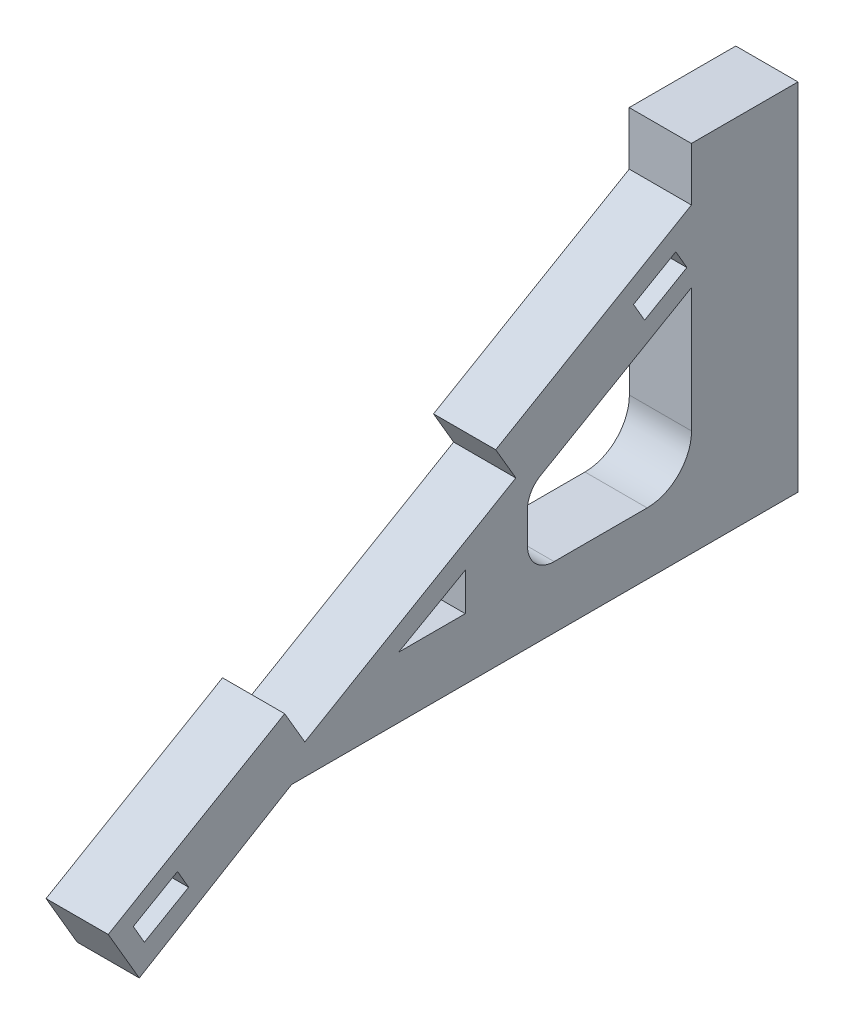
ISO-10303-21;
HEADER;
FILE_DESCRIPTION(('STEP AP214'),'2;1');
FILE_NAME('part.step','',(''),(''),'','','');
FILE_SCHEMA(('AUTOMOTIVE_DESIGN { 1 0 10303 214 1 1 1 1 }'));
ENDSEC;
DATA;
#1=APPLICATION_CONTEXT('core data for automotive mechanical design processes');
#2=APPLICATION_PROTOCOL_DEFINITION('international standard','automotive_design',2000,#1);
#3=PRODUCT_CONTEXT('',#1,'mechanical');
#4=PRODUCT('Part','Part','',(#3));
#5=PRODUCT_RELATED_PRODUCT_CATEGORY('part','',(#4));
#6=PRODUCT_DEFINITION_FORMATION('','',#4);
#7=PRODUCT_DEFINITION_CONTEXT('part definition',#1,'design');
#8=PRODUCT_DEFINITION('design','',#6,#7);
#9=PRODUCT_DEFINITION_SHAPE('','',#8);
#10=(LENGTH_UNIT() NAMED_UNIT(*) SI_UNIT(.MILLI.,.METRE.));
#11=(NAMED_UNIT(*) PLANE_ANGLE_UNIT() SI_UNIT($,.RADIAN.));
#12=(NAMED_UNIT(*) SI_UNIT($,.STERADIAN.) SOLID_ANGLE_UNIT());
#13=UNCERTAINTY_MEASURE_WITH_UNIT(LENGTH_MEASURE(1.E-05),#10,'distance_accuracy_value','');
#14=(GEOMETRIC_REPRESENTATION_CONTEXT(3) GLOBAL_UNCERTAINTY_ASSIGNED_CONTEXT((#13)) GLOBAL_UNIT_ASSIGNED_CONTEXT((#10,
#11,#12)) REPRESENTATION_CONTEXT('',''));
#15=CARTESIAN_POINT('',(0.,0.,0.));
#16=DIRECTION('',(0.,0.,1.));
#17=DIRECTION('',(1.,0.,0.));
#18=AXIS2_PLACEMENT_3D('',#15,#16,#17);
#19=CARTESIAN_POINT('',(-7.,-27.6650791483747,38.937098947957));
#20=DIRECTION('',(0.,-0.85757405597835,-0.514360514146296));
#21=DIRECTION('',(0.,0.514360514146296,-0.85757405597835));
#22=AXIS2_PLACEMENT_3D('',#19,#20,#21);
#23=PLANE('',#22);
#24=DIRECTION('',(0.,0.514360514146296,-0.85757405597835));
#25=VECTOR('',#24,1.);
#26=CARTESIAN_POINT('',(0.,-27.6650791483747,38.937098947957));
#27=LINE('',#26,#25);
#28=CARTESIAN_POINT('',(0.,-27.6650791483747,38.937098947957));
#29=VERTEX_POINT('',#28);
#30=CARTESIAN_POINT('',(0.,-17.3778688654487,21.78561782839));
#31=VERTEX_POINT('',#30);
#32=EDGE_CURVE('E345',#29,#31,#27,.T.);
#33=ORIENTED_EDGE('',*,*,#32,.F.);
#34=DIRECTION('',(1.,0.,0.));
#35=VECTOR('',#34,1.);
#36=CARTESIAN_POINT('',(-7.,-27.6650791483747,38.937098947957));
#37=LINE('',#36,#35);
#38=CARTESIAN_POINT('',(-7.,-27.6650791483747,38.937098947957));
#39=VERTEX_POINT('',#38);
#40=EDGE_CURVE('E416',#39,#29,#37,.T.);
#41=ORIENTED_EDGE('',*,*,#40,.F.);
#42=DIRECTION('',(0.,0.514360514146296,-0.85757405597835));
#43=VECTOR('',#42,1.);
#44=CARTESIAN_POINT('',(-7.,-27.6650791483747,38.937098947957));
#45=LINE('',#44,#43);
#46=CARTESIAN_POINT('',(-7.,-17.3778688654487,21.78561782839));
#47=VERTEX_POINT('',#46);
#48=EDGE_CURVE('E350',#39,#47,#45,.T.);
#49=ORIENTED_EDGE('',*,*,#48,.T.);
#50=DIRECTION('',(1.,0.,0.));
#51=VECTOR('',#50,1.);
#52=CARTESIAN_POINT('',(-7.,-17.3778688654487,21.78561782839));
#53=LINE('',#52,#51);
#54=EDGE_CURVE('E384',#47,#31,#53,.T.);
#55=ORIENTED_EDGE('',*,*,#54,.T.);
#56=EDGE_LOOP('',(#33,#41,#49,#55));
#57=FACE_BOUND('',#56,.T.);
#58=ADVANCED_FACE('F33',(#57),#23,.T.);
#59=CARTESIAN_POINT('',(-7.,-21.6703628112709,42.4338082635359));
#60=DIRECTION('',(0.,-0.503848604550291,0.863791979409814));
#61=DIRECTION('',(0.,-0.863791979409814,-0.503848604550291));
#62=AXIS2_PLACEMENT_3D('',#59,#60,#61);
#63=PLANE('',#62);
#64=DIRECTION('',(0.,-0.863791979409814,-0.503848604550291));
#65=VECTOR('',#64,1.);
#66=CARTESIAN_POINT('',(0.,-21.6703628112709,42.4338082635359));
#67=LINE('',#66,#65);
#68=CARTESIAN_POINT('',(0.,-21.6703628112709,42.4338082635359));
#69=VERTEX_POINT('',#68);
#70=EDGE_CURVE('E354',#69,#29,#67,.T.);
#71=ORIENTED_EDGE('',*,*,#70,.F.);
#72=DIRECTION('',(1.,0.,0.));
#73=VECTOR('',#72,1.);
#74=CARTESIAN_POINT('',(-7.,-21.6703628112709,42.4338082635359));
#75=LINE('',#74,#73);
#76=CARTESIAN_POINT('',(-7.,-21.6703628112709,42.4338082635359));
#77=VERTEX_POINT('',#76);
#78=EDGE_CURVE('E419',#77,#69,#75,.T.);
#79=ORIENTED_EDGE('',*,*,#78,.F.);
#80=DIRECTION('',(0.,-0.863791979409814,-0.503848604550291));
#81=VECTOR('',#80,1.);
#82=CARTESIAN_POINT('',(-7.,-21.6703628112709,42.4338082635359));
#83=LINE('',#82,#81);
#84=EDGE_CURVE('E381',#77,#39,#83,.T.);
#85=ORIENTED_EDGE('',*,*,#84,.T.);
#86=ORIENTED_EDGE('',*,*,#40,.T.);
#87=EDGE_LOOP('',(#71,#79,#85,#86));
#88=FACE_BOUND('',#87,.T.);
#89=ADVANCED_FACE('F476',(#88),#63,.T.);
#90=CARTESIAN_POINT('',(-7.,-10.0818449066142,22.5665927371102));
#91=DIRECTION('',(0.,0.863791979409814,0.503848604550291));
#92=DIRECTION('',(0.,-0.503848604550291,0.863791979409814));
#93=AXIS2_PLACEMENT_3D('',#90,#91,#92);
#94=PLANE('',#93);
#95=DIRECTION('',(0.,-0.503848604550291,0.863791979409814));
#96=VECTOR('',#95,1.);
#97=CARTESIAN_POINT('',(0.,-10.0818449066142,22.5665927371102));
#98=LINE('',#97,#96);
#99=CARTESIAN_POINT('',(0.,-10.0818449066142,22.5665927371102));
#100=VERTEX_POINT('',#99);
#101=EDGE_CURVE('E411',#100,#69,#98,.T.);
#102=ORIENTED_EDGE('',*,*,#101,.F.);
#103=DIRECTION('',(1.,0.,0.));
#104=VECTOR('',#103,1.);
#105=CARTESIAN_POINT('',(-7.,-10.0818449066142,22.5665927371102));
#106=LINE('',#105,#104);
#107=CARTESIAN_POINT('',(-7.,-10.0818449066142,22.5665927371102));
#108=VERTEX_POINT('',#107);
#109=EDGE_CURVE('E421',#108,#100,#106,.T.);
#110=ORIENTED_EDGE('',*,*,#109,.F.);
#111=DIRECTION('',(0.,-0.503848604550291,0.863791979409814));
#112=VECTOR('',#111,1.);
#113=CARTESIAN_POINT('',(-7.,-10.0818449066142,22.5665927371102));
#114=LINE('',#113,#112);
#115=EDGE_CURVE('E378',#108,#77,#114,.T.);
#116=ORIENTED_EDGE('',*,*,#115,.T.);
#117=ORIENTED_EDGE('',*,*,#78,.T.);
#118=EDGE_LOOP('',(#102,#110,#116,#117));
#119=FACE_BOUND('',#118,.T.);
#120=ADVANCED_FACE('F482',(#119),#94,.T.);
#121=CARTESIAN_POINT('',(-7.,-13.9689088139583,20.2992740166338));
#122=DIRECTION('',(0.,0.503848604550291,-0.863791979409814));
#123=DIRECTION('',(0.,0.863791979409814,0.503848604550291));
#124=AXIS2_PLACEMENT_3D('',#121,#122,#123);
#125=PLANE('',#124);
#126=DIRECTION('',(0.,0.863791979409814,0.503848604550291));
#127=VECTOR('',#126,1.);
#128=CARTESIAN_POINT('',(0.,-13.9689088139583,20.2992740166338));
#129=LINE('',#128,#127);
#130=CARTESIAN_POINT('',(0.,-13.9689088139583,20.2992740166338));
#131=VERTEX_POINT('',#130);
#132=EDGE_CURVE('E408',#131,#100,#129,.T.);
#133=ORIENTED_EDGE('',*,*,#132,.F.);
#134=DIRECTION('',(1.,0.,0.));
#135=VECTOR('',#134,1.);
#136=CARTESIAN_POINT('',(-7.,-13.9689088139583,20.2992740166338));
#137=LINE('',#136,#135);
#138=CARTESIAN_POINT('',(-7.,-13.9689088139583,20.2992740166338));
#139=VERTEX_POINT('',#138);
#140=EDGE_CURVE('E423',#139,#131,#137,.T.);
#141=ORIENTED_EDGE('',*,*,#140,.F.);
#142=DIRECTION('',(0.,0.863791979409814,0.503848604550291));
#143=VECTOR('',#142,1.);
#144=CARTESIAN_POINT('',(-7.,-13.9689088139583,20.2992740166338));
#145=LINE('',#144,#143);
#146=EDGE_CURVE('E375',#139,#108,#145,.T.);
#147=ORIENTED_EDGE('',*,*,#146,.T.);
#148=ORIENTED_EDGE('',*,*,#109,.T.);
#149=EDGE_LOOP('',(#133,#141,#147,#148));
#150=FACE_BOUND('',#149,.T.);
#151=ADVANCED_FACE('F555',(#150),#125,.T.);
#152=CARTESIAN_POINT('',(-7.,-0.113072188825318,-3.45500541713603));
#153=DIRECTION('',(0.,0.863791979409814,0.503848604550291));
#154=DIRECTION('',(0.,-0.503848604550291,0.863791979409814));
#155=AXIS2_PLACEMENT_3D('',#152,#153,#154);
#156=PLANE('',#155);
#157=DIRECTION('',(0.,-0.503848604550291,0.863791979409814));
#158=VECTOR('',#157,1.);
#159=CARTESIAN_POINT('',(0.,-0.113072188825318,-3.45500541713603));
#160=LINE('',#159,#158);
#161=CARTESIAN_POINT('',(0.,-0.113072188825318,-3.45500541713603));
#162=VERTEX_POINT('',#161);
#163=EDGE_CURVE('E405',#162,#131,#160,.T.);
#164=ORIENTED_EDGE('',*,*,#163,.F.);
#165=DIRECTION('',(1.,0.,0.));
#166=VECTOR('',#165,1.);
#167=CARTESIAN_POINT('',(-7.,-0.113072188825318,-3.45500541713603));
#168=LINE('',#167,#166);
#169=CARTESIAN_POINT('',(-7.,-0.113072188825318,-3.45500541713603));
#170=VERTEX_POINT('',#169);
#171=EDGE_CURVE('E425',#170,#162,#168,.T.);
#172=ORIENTED_EDGE('',*,*,#171,.F.);
#173=DIRECTION('',(0.,-0.503848604550291,0.863791979409814));
#174=VECTOR('',#173,1.);
#175=CARTESIAN_POINT('',(-7.,-0.113072188825318,-3.45500541713603));
#176=LINE('',#175,#174);
#177=EDGE_CURVE('E372',#170,#139,#176,.T.);
#178=ORIENTED_EDGE('',*,*,#177,.T.);
#179=ORIENTED_EDGE('',*,*,#140,.T.);
#180=EDGE_LOOP('',(#164,#172,#178,#179));
#181=FACE_BOUND('',#180,.T.);
#182=ADVANCED_FACE('F559',(#181),#156,.T.);
#183=CARTESIAN_POINT('',(-7.,3.77399171851884,-1.18768669665972));
#184=DIRECTION('',(0.,-0.503848604550291,0.863791979409814));
#185=DIRECTION('',(0.,-0.863791979409814,-0.503848604550291));
#186=AXIS2_PLACEMENT_3D('',#183,#184,#185);
#187=PLANE('',#186);
#188=DIRECTION('',(0.,-0.863791979409814,-0.503848604550291));
#189=VECTOR('',#188,1.);
#190=CARTESIAN_POINT('',(0.,3.77399171851884,-1.18768669665972));
#191=LINE('',#190,#189);
#192=CARTESIAN_POINT('',(0.,3.77399171851884,-1.18768669665972));
#193=VERTEX_POINT('',#192);
#194=EDGE_CURVE('E402',#193,#162,#191,.T.);
#195=ORIENTED_EDGE('',*,*,#194,.F.);
#196=DIRECTION('',(1.,0.,0.));
#197=VECTOR('',#196,1.);
#198=CARTESIAN_POINT('',(-7.,3.77399171851884,-1.18768669665972));
#199=LINE('',#198,#197);
#200=CARTESIAN_POINT('',(-7.,3.77399171851884,-1.18768669665972));
#201=VERTEX_POINT('',#200);
#202=EDGE_CURVE('E427',#201,#193,#199,.T.);
#203=ORIENTED_EDGE('',*,*,#202,.F.);
#204=DIRECTION('',(0.,-0.863791979409814,-0.503848604550291));
#205=VECTOR('',#204,1.);
#206=CARTESIAN_POINT('',(-7.,3.77399171851884,-1.18768669665972));
#207=LINE('',#206,#205);
#208=EDGE_CURVE('E369',#201,#170,#207,.T.);
#209=ORIENTED_EDGE('',*,*,#208,.T.);
#210=ORIENTED_EDGE('',*,*,#171,.T.);
#211=EDGE_LOOP('',(#195,#203,#209,#210));
#212=FACE_BOUND('',#211,.T.);
#213=ADVANCED_FACE('F563',(#212),#187,.T.);
#214=CARTESIAN_POINT('',(-7.,3.77399171851884,-1.18768669665972));
#215=DIRECTION('',(0.,0.863791979409813,0.503848604550292));
#216=DIRECTION('',(0.,-0.503848604550292,0.863791979409814));
#217=AXIS2_PLACEMENT_3D('',#214,#215,#216);
#218=PLANE('',#217);
#219=DIRECTION('',(0.,-0.503848604550292,0.863791979409813));
#220=VECTOR('',#219,1.);
#221=CARTESIAN_POINT('',(0.,3.77399171851884,-1.18768669665972));
#222=LINE('',#221,#220);
#223=CARTESIAN_POINT('',(0.,16.6221311345513,-23.21438217161));
#224=VERTEX_POINT('',#223);
#225=EDGE_CURVE('E399',#224,#193,#222,.T.);
#226=ORIENTED_EDGE('',*,*,#225,.F.);
#227=DIRECTION('',(1.,0.,0.));
#228=VECTOR('',#227,1.);
#229=CARTESIAN_POINT('',(-7.,16.6221311345513,-23.21438217161));
#230=LINE('',#229,#228);
#231=CARTESIAN_POINT('',(-7.,16.6221311345513,-23.21438217161));
#232=VERTEX_POINT('',#231);
#233=EDGE_CURVE('E429',#232,#224,#230,.T.);
#234=ORIENTED_EDGE('',*,*,#233,.F.);
#235=DIRECTION('',(0.,-0.503848604550292,0.863791979409813));
#236=VECTOR('',#235,1.);
#237=CARTESIAN_POINT('',(-7.,3.77399171851884,-1.18768669665972));
#238=LINE('',#237,#236);
#239=EDGE_CURVE('E366',#232,#201,#238,.T.);
#240=ORIENTED_EDGE('',*,*,#239,.T.);
#241=ORIENTED_EDGE('',*,*,#202,.T.);
#242=EDGE_LOOP('',(#226,#234,#240,#241));
#243=FACE_BOUND('',#242,.T.);
#244=ADVANCED_FACE('F567',(#243),#218,.T.);
#245=CARTESIAN_POINT('',(-7.,22.6221311345513,-23.21438217161));
#246=DIRECTION('',(0.,0.,1.));
#247=DIRECTION('',(1.,0.,0.));
#248=AXIS2_PLACEMENT_3D('',#245,#246,#247);
#249=PLANE('',#248);
#250=DIRECTION('',(0.,-1.,0.));
#251=VECTOR('',#250,1.);
#252=CARTESIAN_POINT('',(0.,22.6221311345513,-23.21438217161));
#253=LINE('',#252,#251);
#254=CARTESIAN_POINT('',(0.,22.6221311345513,-23.21438217161));
#255=VERTEX_POINT('',#254);
#256=EDGE_CURVE('E396',#255,#224,#253,.T.);
#257=ORIENTED_EDGE('',*,*,#256,.F.);
#258=DIRECTION('',(1.,0.,0.));
#259=VECTOR('',#258,1.);
#260=CARTESIAN_POINT('',(-7.,22.6221311345513,-23.21438217161));
#261=LINE('',#260,#259);
#262=CARTESIAN_POINT('',(-7.,22.6221311345513,-23.21438217161));
#263=VERTEX_POINT('',#262);
#264=EDGE_CURVE('E431',#263,#255,#261,.T.);
#265=ORIENTED_EDGE('',*,*,#264,.F.);
#266=DIRECTION('',(0.,-1.,0.));
#267=VECTOR('',#266,1.);
#268=CARTESIAN_POINT('',(-7.,22.6221311345513,-23.21438217161));
#269=LINE('',#268,#267);
#270=EDGE_CURVE('E363',#263,#232,#269,.T.);
#271=ORIENTED_EDGE('',*,*,#270,.T.);
#272=ORIENTED_EDGE('',*,*,#233,.T.);
#273=EDGE_LOOP('',(#257,#265,#271,#272));
#274=FACE_BOUND('',#273,.T.);
#275=ADVANCED_FACE('F571',(#274),#249,.T.);
#276=CARTESIAN_POINT('',(-7.,22.6221311345513,-35.21438217161));
#277=DIRECTION('',(0.,1.,0.));
#278=DIRECTION('',(0.,0.,1.));
#279=AXIS2_PLACEMENT_3D('',#276,#277,#278);
#280=PLANE('',#279);
#281=DIRECTION('',(0.,0.,1.));
#282=VECTOR('',#281,1.);
#283=CARTESIAN_POINT('',(0.,22.6221311345513,-35.21438217161));
#284=LINE('',#283,#282);
#285=CARTESIAN_POINT('',(0.,22.6221311345513,-35.21438217161));
#286=VERTEX_POINT('',#285);
#287=EDGE_CURVE('E393',#286,#255,#284,.T.);
#288=ORIENTED_EDGE('',*,*,#287,.F.);
#289=DIRECTION('',(1.,0.,0.));
#290=VECTOR('',#289,1.);
#291=CARTESIAN_POINT('',(-7.,22.6221311345513,-35.21438217161));
#292=LINE('',#291,#290);
#293=CARTESIAN_POINT('',(-7.,22.6221311345513,-35.21438217161));
#294=VERTEX_POINT('',#293);
#295=EDGE_CURVE('E433',#294,#286,#292,.T.);
#296=ORIENTED_EDGE('',*,*,#295,.F.);
#297=DIRECTION('',(0.,0.,1.));
#298=VECTOR('',#297,1.);
#299=CARTESIAN_POINT('',(-7.,22.6221311345513,-35.21438217161));
#300=LINE('',#299,#298);
#301=EDGE_CURVE('E360',#294,#263,#300,.T.);
#302=ORIENTED_EDGE('',*,*,#301,.T.);
#303=ORIENTED_EDGE('',*,*,#264,.T.);
#304=EDGE_LOOP('',(#288,#296,#302,#303));
#305=FACE_BOUND('',#304,.T.);
#306=ADVANCED_FACE('F575',(#305),#280,.T.);
#307=CARTESIAN_POINT('',(-7.,-17.3778688654487,-35.21438217161));
#308=DIRECTION('',(0.,0.,-1.));
#309=DIRECTION('',(0.,1.,0.));
#310=AXIS2_PLACEMENT_3D('',#307,#308,#309);
#311=PLANE('',#310);
#312=DIRECTION('',(0.,1.,0.));
#313=VECTOR('',#312,1.);
#314=CARTESIAN_POINT('',(0.,-17.3778688654487,-35.21438217161));
#315=LINE('',#314,#313);
#316=CARTESIAN_POINT('',(0.,-17.3778688654487,-35.21438217161));
#317=VERTEX_POINT('',#316);
#318=EDGE_CURVE('E390',#317,#286,#315,.T.);
#319=ORIENTED_EDGE('',*,*,#318,.F.);
#320=DIRECTION('',(1.,0.,0.));
#321=VECTOR('',#320,1.);
#322=CARTESIAN_POINT('',(-7.,-17.3778688654487,-35.21438217161));
#323=LINE('',#322,#321);
#324=CARTESIAN_POINT('',(-7.,-17.3778688654487,-35.21438217161));
#325=VERTEX_POINT('',#324);
#326=EDGE_CURVE('E435',#325,#317,#323,.T.);
#327=ORIENTED_EDGE('',*,*,#326,.F.);
#328=DIRECTION('',(0.,1.,0.));
#329=VECTOR('',#328,1.);
#330=CARTESIAN_POINT('',(-7.,-17.3778688654487,-35.21438217161));
#331=LINE('',#330,#329);
#332=EDGE_CURVE('E357',#325,#294,#331,.T.);
#333=ORIENTED_EDGE('',*,*,#332,.T.);
#334=ORIENTED_EDGE('',*,*,#295,.T.);
#335=EDGE_LOOP('',(#319,#327,#333,#334));
#336=FACE_BOUND('',#335,.T.);
#337=ADVANCED_FACE('F578',(#336),#311,.T.);
#338=CARTESIAN_POINT('',(-7.,-17.3778688654487,21.78561782839));
#339=DIRECTION('',(0.,-1.,0.));
#340=DIRECTION('',(0.,0.,-1.));
#341=AXIS2_PLACEMENT_3D('',#338,#339,#340);
#342=PLANE('',#341);
#343=DIRECTION('',(0.,0.,-1.));
#344=VECTOR('',#343,1.);
#345=CARTESIAN_POINT('',(0.,-17.3778688654487,21.78561782839));
#346=LINE('',#345,#344);
#347=EDGE_CURVE('E387',#31,#317,#346,.T.);
#348=ORIENTED_EDGE('',*,*,#347,.F.);
#349=ORIENTED_EDGE('',*,*,#54,.F.);
#350=DIRECTION('',(0.,0.,-1.));
#351=VECTOR('',#350,1.);
#352=CARTESIAN_POINT('',(-7.,-17.3778688654487,21.78561782839));
#353=LINE('',#352,#351);
#354=EDGE_CURVE('E353',#47,#325,#353,.T.);
#355=ORIENTED_EDGE('',*,*,#354,.T.);
#356=ORIENTED_EDGE('',*,*,#326,.T.);
#357=EDGE_LOOP('',(#348,#349,#355,#356));
#358=FACE_BOUND('',#357,.T.);
#359=ADVANCED_FACE('F488',(#358),#342,.T.);
#360=CARTESIAN_POINT('',(-7.,0.,0.));
#361=DIRECTION('',(-1.,0.,0.));
#362=DIRECTION('',(0.,0.,1.));
#363=AXIS2_PLACEMENT_3D('',#360,#361,#362);
#364=PLANE('',#363);
#365=DIRECTION('',(0.,-0.500981396791888,0.865458052171478));
#366=VECTOR('',#365,1.);
#367=CARTESIAN_POINT('',(-7.,-1.3998859868204,-6.01160039361903));
#368=LINE('',#367,#366);
#369=CARTESIAN_POINT('',(-7.,8.5695865463671,-23.2341167085985));
#370=VERTEX_POINT('',#369);
#371=CARTESIAN_POINT('',(-7.,-1.3998859868204,-6.01160039361903));
#372=VERTEX_POINT('',#371);
#373=EDGE_CURVE('E229',#370,#372,#368,.T.);
#374=ORIENTED_EDGE('',*,*,#373,.T.);
#375=CARTESIAN_POINT('',(-7.,-3.8343262822422,-7.7647405614398));
#376=DIRECTION('',(-1.,0.,0.));
#377=DIRECTION('',(0.,0.,1.));
#378=AXIS2_PLACEMENT_3D('',#375,#376,#377);
#379=CIRCLE('',#378,3.);
#380=CARTESIAN_POINT('',(-7.,-3.8343262822422,-4.7647405614398));
#381=VERTEX_POINT('',#380);
#382=EDGE_CURVE('E451',#372,#381,#379,.F.);
#383=ORIENTED_EDGE('',*,*,#382,.T.);
#384=DIRECTION('',(0.,-1.,0.));
#385=VECTOR('',#384,1.);
#386=CARTESIAN_POINT('',(-7.,-1.3998859868204,-4.7647405614398));
#387=LINE('',#386,#385);
#388=CARTESIAN_POINT('',(-7.,-7.41786886544872,-4.7647405614398));
#389=VERTEX_POINT('',#388);
#390=EDGE_CURVE('E259',#381,#389,#387,.T.);
#391=ORIENTED_EDGE('',*,*,#390,.T.);
#392=CARTESIAN_POINT('',(-7.,-7.41786886544872,-7.7647405614398));
#393=DIRECTION('',(-1.,0.,0.));
#394=DIRECTION('',(0.,0.,1.));
#395=AXIS2_PLACEMENT_3D('',#392,#393,#394);
#396=CIRCLE('',#395,3.);
#397=CARTESIAN_POINT('',(-7.,-10.4178688654487,-7.7647405614398));
#398=VERTEX_POINT('',#397);
#399=EDGE_CURVE('E447',#389,#398,#396,.F.);
#400=ORIENTED_EDGE('',*,*,#399,.T.);
#401=DIRECTION('',(0.,0.,-1.));
#402=VECTOR('',#401,1.);
#403=CARTESIAN_POINT('',(-7.,-10.4178688654487,-4.7647405614398));
#404=LINE('',#403,#402);
#405=CARTESIAN_POINT('',(-7.,-10.4178688654487,-18.2341167085985));
#406=VERTEX_POINT('',#405);
#407=EDGE_CURVE('E235',#398,#406,#404,.T.);
#408=ORIENTED_EDGE('',*,*,#407,.T.);
#409=CARTESIAN_POINT('',(-7.,-5.41786886544872,-18.2341167085985));
#410=DIRECTION('',(-1.,0.,0.));
#411=DIRECTION('',(0.,0.,1.));
#412=AXIS2_PLACEMENT_3D('',#409,#410,#411);
#413=CIRCLE('',#412,5.);
#414=CARTESIAN_POINT('',(-7.,-5.41786886544873,-23.2341167085985));
#415=VERTEX_POINT('',#414);
#416=EDGE_CURVE('E11',#406,#415,#413,.F.);
#417=ORIENTED_EDGE('',*,*,#416,.T.);
#418=DIRECTION('',(0.,1.,0.));
#419=VECTOR('',#418,1.);
#420=CARTESIAN_POINT('',(-7.,8.5695865463671,-23.2341167085985));
#421=LINE('',#420,#419);
#422=EDGE_CURVE('E224',#415,#370,#421,.T.);
#423=ORIENTED_EDGE('',*,*,#422,.T.);
#424=EDGE_LOOP('',(#374,#383,#391,#400,#408,#417,#423));
#425=FACE_BOUND('',#424,.T.);
#426=DIRECTION('',(0.,-0.500981396791888,0.865458052171478));
#427=VECTOR('',#426,1.);
#428=CARTESIAN_POINT('',(-7.,12.9382598453727,-21.4594061879204));
#429=LINE('',#428,#427);
#430=CARTESIAN_POINT('',(-7.,12.9382598453727,-21.4594061879204));
#431=VERTEX_POINT('',#430);
#432=CARTESIAN_POINT('',(-7.,10.1828615425791,-16.6993858291544));
#433=VERTEX_POINT('',#432);
#434=EDGE_CURVE('E262',#431,#433,#429,.T.);
#435=ORIENTED_EDGE('',*,*,#434,.T.);
#436=DIRECTION('',(0.,-0.865458052171479,-0.500981396791887));
#437=VECTOR('',#436,1.);
#438=CARTESIAN_POINT('',(-7.,10.1828615425791,-16.6993858291544));
#439=LINE('',#438,#437);
#440=CARTESIAN_POINT('',(-7.,8.01921603179754,-17.9518395413062));
#441=VERTEX_POINT('',#440);
#442=EDGE_CURVE('E265',#433,#441,#439,.T.);
#443=ORIENTED_EDGE('',*,*,#442,.T.);
#444=DIRECTION('',(0.,0.500981396791888,-0.865458052171478));
#445=VECTOR('',#444,1.);
#446=CARTESIAN_POINT('',(-7.,8.01921603179754,-17.9518395413062));
#447=LINE('',#446,#445);
#448=CARTESIAN_POINT('',(-7.,10.7746143345912,-22.7118599000722));
#449=VERTEX_POINT('',#448);
#450=EDGE_CURVE('E269',#441,#449,#447,.T.);
#451=ORIENTED_EDGE('',*,*,#450,.T.);
#452=DIRECTION('',(0.,0.865458052171478,0.500981396791889));
#453=VECTOR('',#452,1.);
#454=CARTESIAN_POINT('',(-7.,10.7746143345912,-22.7118599000722));
#455=LINE('',#454,#453);
#456=EDGE_CURVE('E272',#449,#431,#455,.T.);
#457=ORIENTED_EDGE('',*,*,#456,.T.);
#458=EDGE_LOOP('',(#435,#443,#451,#457));
#459=FACE_BOUND('',#458,.T.);
#460=DIRECTION('',(0.,0.500074816710874,-0.865982204027072));
#461=VECTOR('',#460,1.);
#462=CARTESIAN_POINT('',(-7.,-21.5940753603504,33.3843022393859));
#463=LINE('',#462,#461);
#464=CARTESIAN_POINT('',(-7.,-24.4695055564379,38.3636999125415));
#465=VERTEX_POINT('',#464);
#466=CARTESIAN_POINT('',(-7.,-21.5940753603504,33.3843022393859));
#467=VERTEX_POINT('',#466);
#468=EDGE_CURVE('E294',#465,#467,#463,.T.);
#469=ORIENTED_EDGE('',*,*,#468,.T.);
#470=DIRECTION('',(0.,0.865982204027073,0.500074816710872));
#471=VECTOR('',#470,1.);
#472=CARTESIAN_POINT('',(-7.,-19.4291198502827,34.6344892811631));
#473=LINE('',#472,#471);
#474=CARTESIAN_POINT('',(-7.,-19.4291198502827,34.6344892811631));
#475=VERTEX_POINT('',#474);
#476=EDGE_CURVE('E297',#467,#475,#473,.T.);
#477=ORIENTED_EDGE('',*,*,#476,.T.);
#478=DIRECTION('',(0.,-0.500074816710877,0.865982204027071));
#479=VECTOR('',#478,1.);
#480=CARTESIAN_POINT('',(-7.,-22.3045500463703,39.6138869543187));
#481=LINE('',#480,#479);
#482=CARTESIAN_POINT('',(-7.,-22.3045500463703,39.6138869543187));
#483=VERTEX_POINT('',#482);
#484=EDGE_CURVE('E301',#475,#483,#481,.T.);
#485=ORIENTED_EDGE('',*,*,#484,.T.);
#486=DIRECTION('',(0.,-0.865982204027069,-0.500074816710879));
#487=VECTOR('',#486,1.);
#488=CARTESIAN_POINT('',(-7.,-24.4695055564379,38.3636999125415));
#489=LINE('',#488,#487);
#490=EDGE_CURVE('E304',#483,#465,#489,.T.);
#491=ORIENTED_EDGE('',*,*,#490,.T.);
#492=EDGE_LOOP('',(#469,#477,#485,#491));
#493=FACE_BOUND('',#492,.T.);
#494=DIRECTION('',(0.,-0.492954378318377,0.870055159686294));
#495=VECTOR('',#494,1.);
#496=CARTESIAN_POINT('',(-7.,-6.24837216225993,2.23525943856018));
#497=LINE('',#496,#495);
#498=CARTESIAN_POINT('',(-7.,-6.24837216225993,2.23525943856018));
#499=VERTEX_POINT('',#498);
#500=CARTESIAN_POINT('',(-7.,-10.4978688654487,9.73554079378812));
#501=VERTEX_POINT('',#500);
#502=EDGE_CURVE('E326',#499,#501,#497,.T.);
#503=ORIENTED_EDGE('',*,*,#502,.T.);
#504=DIRECTION('',(0.,0.,-1.));
#505=VECTOR('',#504,1.);
#506=CARTESIAN_POINT('',(-7.,-10.4978688654487,9.73554079378812));
#507=LINE('',#506,#505);
#508=CARTESIAN_POINT('',(-7.,-10.4978688654487,2.2352594385602));
#509=VERTEX_POINT('',#508);
#510=EDGE_CURVE('E329',#501,#509,#507,.T.);
#511=ORIENTED_EDGE('',*,*,#510,.T.);
#512=DIRECTION('',(0.,1.,0.));
#513=VECTOR('',#512,1.);
#514=CARTESIAN_POINT('',(-7.,-10.4978688654487,2.2352594385602));
#515=LINE('',#514,#513);
#516=EDGE_CURVE('E333',#509,#499,#515,.T.);
#517=ORIENTED_EDGE('',*,*,#516,.T.);
#518=EDGE_LOOP('',(#503,#511,#517));
#519=FACE_BOUND('',#518,.T.);
#520=ORIENTED_EDGE('',*,*,#48,.F.);
#521=ORIENTED_EDGE('',*,*,#84,.F.);
#522=ORIENTED_EDGE('',*,*,#115,.F.);
#523=ORIENTED_EDGE('',*,*,#146,.F.);
#524=ORIENTED_EDGE('',*,*,#177,.F.);
#525=ORIENTED_EDGE('',*,*,#208,.F.);
#526=ORIENTED_EDGE('',*,*,#239,.F.);
#527=ORIENTED_EDGE('',*,*,#270,.F.);
#528=ORIENTED_EDGE('',*,*,#301,.F.);
#529=ORIENTED_EDGE('',*,*,#332,.F.);
#530=ORIENTED_EDGE('',*,*,#354,.F.);
#531=EDGE_LOOP('',(#520,#521,#522,#523,#524,#525,#526,#527,#528,#529,#530));
#532=FACE_BOUND('',#531,.T.);
#533=ADVANCED_FACE('F226',(#425,#459,#493,#519,#532),#364,.T.);
#534=CARTESIAN_POINT('',(0.,0.,0.));
#535=DIRECTION('',(-1.,0.,0.));
#536=DIRECTION('',(0.,0.,1.));
#537=AXIS2_PLACEMENT_3D('',#534,#535,#536);
#538=PLANE('',#537);
#539=DIRECTION('',(0.,0.,-1.));
#540=VECTOR('',#539,1.);
#541=CARTESIAN_POINT('',(0.,-10.4178688654487,-4.7647405614398));
#542=LINE('',#541,#540);
#543=CARTESIAN_POINT('',(0.,-10.4178688654487,-7.7647405614398));
#544=VERTEX_POINT('',#543);
#545=CARTESIAN_POINT('',(0.,-10.4178688654487,-18.2341167085985));
#546=VERTEX_POINT('',#545);
#547=EDGE_CURVE('E254',#544,#546,#542,.T.);
#548=ORIENTED_EDGE('',*,*,#547,.F.);
#549=CARTESIAN_POINT('',(0.,-7.41786886544872,-7.7647405614398));
#550=DIRECTION('',(-1.,0.,0.));
#551=DIRECTION('',(0.,0.,1.));
#552=AXIS2_PLACEMENT_3D('',#549,#550,#551);
#553=CIRCLE('',#552,3.);
#554=CARTESIAN_POINT('',(0.,-7.41786886544872,-4.7647405614398));
#555=VERTEX_POINT('',#554);
#556=EDGE_CURVE('E445',#544,#555,#553,.T.);
#557=ORIENTED_EDGE('',*,*,#556,.T.);
#558=DIRECTION('',(0.,-1.,0.));
#559=VECTOR('',#558,1.);
#560=CARTESIAN_POINT('',(0.,-1.3998859868204,-4.7647405614398));
#561=LINE('',#560,#559);
#562=CARTESIAN_POINT('',(0.,-3.8343262822422,-4.7647405614398));
#563=VERTEX_POINT('',#562);
#564=EDGE_CURVE('E251',#563,#555,#561,.T.);
#565=ORIENTED_EDGE('',*,*,#564,.F.);
#566=CARTESIAN_POINT('',(0.,-3.8343262822422,-7.7647405614398));
#567=DIRECTION('',(-1.,0.,0.));
#568=DIRECTION('',(0.,0.,1.));
#569=AXIS2_PLACEMENT_3D('',#566,#567,#568);
#570=CIRCLE('',#569,3.);
#571=CARTESIAN_POINT('',(0.,-1.3998859868204,-6.01160039361903));
#572=VERTEX_POINT('',#571);
#573=EDGE_CURVE('E449',#563,#572,#570,.T.);
#574=ORIENTED_EDGE('',*,*,#573,.T.);
#575=DIRECTION('',(0.,-0.500981396791888,0.865458052171478));
#576=VECTOR('',#575,1.);
#577=CARTESIAN_POINT('',(0.,-1.3998859868204,-6.01160039361903));
#578=LINE('',#577,#576);
#579=CARTESIAN_POINT('',(0.,8.5695865463671,-23.2341167085985));
#580=VERTEX_POINT('',#579);
#581=EDGE_CURVE('E257',#580,#572,#578,.T.);
#582=ORIENTED_EDGE('',*,*,#581,.F.);
#583=DIRECTION('',(0.,1.,0.));
#584=VECTOR('',#583,1.);
#585=CARTESIAN_POINT('',(0.,8.5695865463671,-23.2341167085985));
#586=LINE('',#585,#584);
#587=CARTESIAN_POINT('',(0.,-5.41786886544873,-23.2341167085985));
#588=VERTEX_POINT('',#587);
#589=EDGE_CURVE('E240',#588,#580,#586,.T.);
#590=ORIENTED_EDGE('',*,*,#589,.F.);
#591=CARTESIAN_POINT('',(0.,-5.41786886544872,-18.2341167085985));
#592=DIRECTION('',(-1.,0.,0.));
#593=DIRECTION('',(0.,0.,1.));
#594=AXIS2_PLACEMENT_3D('',#591,#592,#593);
#595=CIRCLE('',#594,5.);
#596=EDGE_CURVE('E41',#588,#546,#595,.T.);
#597=ORIENTED_EDGE('',*,*,#596,.T.);
#598=EDGE_LOOP('',(#548,#557,#565,#574,#582,#590,#597));
#599=FACE_BOUND('',#598,.T.);
#600=DIRECTION('',(0.,-0.865458052171479,-0.500981396791887));
#601=VECTOR('',#600,1.);
#602=CARTESIAN_POINT('',(0.,10.1828615425791,-16.6993858291544));
#603=LINE('',#602,#601);
#604=CARTESIAN_POINT('',(0.,10.1828615425791,-16.6993858291544));
#605=VERTEX_POINT('',#604);
#606=CARTESIAN_POINT('',(0.,8.01921603179754,-17.9518395413062));
#607=VERTEX_POINT('',#606);
#608=EDGE_CURVE('E277',#605,#607,#603,.T.);
#609=ORIENTED_EDGE('',*,*,#608,.F.);
#610=DIRECTION('',(0.,-0.500981396791888,0.865458052171478));
#611=VECTOR('',#610,1.);
#612=CARTESIAN_POINT('',(0.,12.9382598453727,-21.4594061879204));
#613=LINE('',#612,#611);
#614=CARTESIAN_POINT('',(0.,12.9382598453727,-21.4594061879204));
#615=VERTEX_POINT('',#614);
#616=EDGE_CURVE('E260',#615,#605,#613,.T.);
#617=ORIENTED_EDGE('',*,*,#616,.F.);
#618=DIRECTION('',(0.,0.865458052171478,0.500981396791889));
#619=VECTOR('',#618,1.);
#620=CARTESIAN_POINT('',(0.,10.7746143345912,-22.7118599000722));
#621=LINE('',#620,#619);
#622=CARTESIAN_POINT('',(0.,10.7746143345912,-22.7118599000722));
#623=VERTEX_POINT('',#622);
#624=EDGE_CURVE('E266',#623,#615,#621,.T.);
#625=ORIENTED_EDGE('',*,*,#624,.F.);
#626=DIRECTION('',(0.,0.500981396791888,-0.865458052171478));
#627=VECTOR('',#626,1.);
#628=CARTESIAN_POINT('',(0.,8.01921603179754,-17.9518395413062));
#629=LINE('',#628,#627);
#630=EDGE_CURVE('E280',#607,#623,#629,.T.);
#631=ORIENTED_EDGE('',*,*,#630,.F.);
#632=EDGE_LOOP('',(#609,#617,#625,#631));
#633=FACE_BOUND('',#632,.T.);
#634=DIRECTION('',(0.,0.865982204027073,0.500074816710872));
#635=VECTOR('',#634,1.);
#636=CARTESIAN_POINT('',(0.,-19.4291198502827,34.6344892811631));
#637=LINE('',#636,#635);
#638=CARTESIAN_POINT('',(0.,-21.5940753603504,33.3843022393859));
#639=VERTEX_POINT('',#638);
#640=CARTESIAN_POINT('',(0.,-19.4291198502827,34.6344892811631));
#641=VERTEX_POINT('',#640);
#642=EDGE_CURVE('E309',#639,#641,#637,.T.);
#643=ORIENTED_EDGE('',*,*,#642,.F.);
#644=DIRECTION('',(0.,0.500074816710874,-0.865982204027072));
#645=VECTOR('',#644,1.);
#646=CARTESIAN_POINT('',(0.,-21.5940753603504,33.3843022393859));
#647=LINE('',#646,#645);
#648=CARTESIAN_POINT('',(0.,-24.4695055564379,38.3636999125415));
#649=VERTEX_POINT('',#648);
#650=EDGE_CURVE('E287',#649,#639,#647,.T.);
#651=ORIENTED_EDGE('',*,*,#650,.F.);
#652=DIRECTION('',(0.,-0.865982204027069,-0.500074816710879));
#653=VECTOR('',#652,1.);
#654=CARTESIAN_POINT('',(0.,-24.4695055564379,38.3636999125415));
#655=LINE('',#654,#653);
#656=CARTESIAN_POINT('',(0.,-22.3045500463703,39.6138869543187));
#657=VERTEX_POINT('',#656);
#658=EDGE_CURVE('E298',#657,#649,#655,.T.);
#659=ORIENTED_EDGE('',*,*,#658,.F.);
#660=DIRECTION('',(0.,-0.500074816710877,0.865982204027071));
#661=VECTOR('',#660,1.);
#662=CARTESIAN_POINT('',(0.,-22.3045500463703,39.6138869543187));
#663=LINE('',#662,#661);
#664=EDGE_CURVE('E312',#641,#657,#663,.T.);
#665=ORIENTED_EDGE('',*,*,#664,.F.);
#666=EDGE_LOOP('',(#643,#651,#659,#665));
#667=FACE_BOUND('',#666,.T.);
#668=DIRECTION('',(0.,0.,-1.));
#669=VECTOR('',#668,1.);
#670=CARTESIAN_POINT('',(0.,-10.4978688654487,9.73554079378812));
#671=LINE('',#670,#669);
#672=CARTESIAN_POINT('',(0.,-10.4978688654487,9.73554079378812));
#673=VERTEX_POINT('',#672);
#674=CARTESIAN_POINT('',(0.,-10.4978688654487,2.2352594385602));
#675=VERTEX_POINT('',#674);
#676=EDGE_CURVE('E338',#673,#675,#671,.T.);
#677=ORIENTED_EDGE('',*,*,#676,.F.);
#678=DIRECTION('',(0.,-0.492954378318377,0.870055159686294));
#679=VECTOR('',#678,1.);
#680=CARTESIAN_POINT('',(0.,-6.24837216225993,2.23525943856018));
#681=LINE('',#680,#679);
#682=CARTESIAN_POINT('',(0.,-6.24837216225993,2.23525943856018));
#683=VERTEX_POINT('',#682);
#684=EDGE_CURVE('E319',#683,#673,#681,.T.);
#685=ORIENTED_EDGE('',*,*,#684,.F.);
#686=DIRECTION('',(0.,1.,0.));
#687=VECTOR('',#686,1.);
#688=CARTESIAN_POINT('',(0.,-10.4978688654487,2.2352594385602));
#689=LINE('',#688,#687);
#690=EDGE_CURVE('E330',#675,#683,#689,.T.);
#691=ORIENTED_EDGE('',*,*,#690,.F.);
#692=EDGE_LOOP('',(#677,#685,#691));
#693=FACE_BOUND('',#692,.T.);
#694=ORIENTED_EDGE('',*,*,#32,.T.);
#695=ORIENTED_EDGE('',*,*,#347,.T.);
#696=ORIENTED_EDGE('',*,*,#318,.T.);
#697=ORIENTED_EDGE('',*,*,#287,.T.);
#698=ORIENTED_EDGE('',*,*,#256,.T.);
#699=ORIENTED_EDGE('',*,*,#225,.T.);
#700=ORIENTED_EDGE('',*,*,#194,.T.);
#701=ORIENTED_EDGE('',*,*,#163,.T.);
#702=ORIENTED_EDGE('',*,*,#132,.T.);
#703=ORIENTED_EDGE('',*,*,#101,.T.);
#704=ORIENTED_EDGE('',*,*,#70,.T.);
#705=EDGE_LOOP('',(#694,#695,#696,#697,#698,#699,#700,#701,#702,#703,#704));
#706=FACE_BOUND('',#705,.T.);
#707=ADVANCED_FACE('F456',(#599,#633,#667,#693,#706),#538,.F.);
#708=CARTESIAN_POINT('',(-7.,-6.24837216225993,2.23525943856018));
#709=DIRECTION('',(0.,0.870055159686294,0.492954378318377));
#710=DIRECTION('',(0.,-0.492954378318377,0.870055159686294));
#711=AXIS2_PLACEMENT_3D('',#708,#709,#710);
#712=PLANE('',#711);
#713=ORIENTED_EDGE('',*,*,#684,.T.);
#714=DIRECTION('',(1.,0.,0.));
#715=VECTOR('',#714,1.);
#716=CARTESIAN_POINT('',(-7.,-10.4978688654487,9.73554079378812));
#717=LINE('',#716,#715);
#718=EDGE_CURVE('E336',#501,#673,#717,.T.);
#719=ORIENTED_EDGE('',*,*,#718,.F.);
#720=ORIENTED_EDGE('',*,*,#502,.F.);
#721=DIRECTION('',(1.,0.,0.));
#722=VECTOR('',#721,1.);
#723=CARTESIAN_POINT('',(-7.,-6.24837216225993,2.23525943856018));
#724=LINE('',#723,#722);
#725=EDGE_CURVE('E343',#499,#683,#724,.T.);
#726=ORIENTED_EDGE('',*,*,#725,.T.);
#727=EDGE_LOOP('',(#713,#719,#720,#726));
#728=FACE_BOUND('',#727,.T.);
#729=ADVANCED_FACE('F541',(#728),#712,.F.);
#730=CARTESIAN_POINT('',(-7.,-10.4978688654487,2.2352594385602));
#731=DIRECTION('',(0.,0.,-1.));
#732=DIRECTION('',(0.,1.,0.));
#733=AXIS2_PLACEMENT_3D('',#730,#731,#732);
#734=PLANE('',#733);
#735=ORIENTED_EDGE('',*,*,#690,.T.);
#736=ORIENTED_EDGE('',*,*,#725,.F.);
#737=ORIENTED_EDGE('',*,*,#516,.F.);
#738=DIRECTION('',(1.,0.,0.));
#739=VECTOR('',#738,1.);
#740=CARTESIAN_POINT('',(-7.,-10.4978688654487,2.2352594385602));
#741=LINE('',#740,#739);
#742=EDGE_CURVE('E346',#509,#675,#741,.T.);
#743=ORIENTED_EDGE('',*,*,#742,.T.);
#744=EDGE_LOOP('',(#735,#736,#737,#743));
#745=FACE_BOUND('',#744,.T.);
#746=ADVANCED_FACE('F538',(#745),#734,.F.);
#747=CARTESIAN_POINT('',(-7.,-10.4978688654487,9.73554079378812));
#748=DIRECTION('',(0.,-1.,0.));
#749=DIRECTION('',(0.,0.,-1.));
#750=AXIS2_PLACEMENT_3D('',#747,#748,#749);
#751=PLANE('',#750);
#752=ORIENTED_EDGE('',*,*,#676,.T.);
#753=ORIENTED_EDGE('',*,*,#742,.F.);
#754=ORIENTED_EDGE('',*,*,#510,.F.);
#755=ORIENTED_EDGE('',*,*,#718,.T.);
#756=EDGE_LOOP('',(#752,#753,#754,#755));
#757=FACE_BOUND('',#756,.T.);
#758=ADVANCED_FACE('F536',(#757),#751,.F.);
#759=CARTESIAN_POINT('',(-7.,-21.5940753603504,33.3843022393859));
#760=DIRECTION('',(0.,-0.865982204027073,-0.500074816710874));
#761=DIRECTION('',(0.,0.500074816710874,-0.865982204027073));
#762=AXIS2_PLACEMENT_3D('',#759,#760,#761);
#763=PLANE('',#762);
#764=ORIENTED_EDGE('',*,*,#650,.T.);
#765=DIRECTION('',(1.,0.,0.));
#766=VECTOR('',#765,1.);
#767=CARTESIAN_POINT('',(-7.,-21.5940753603504,33.3843022393859));
#768=LINE('',#767,#766);
#769=EDGE_CURVE('E307',#467,#639,#768,.T.);
#770=ORIENTED_EDGE('',*,*,#769,.F.);
#771=ORIENTED_EDGE('',*,*,#468,.F.);
#772=DIRECTION('',(1.,0.,0.));
#773=VECTOR('',#772,1.);
#774=CARTESIAN_POINT('',(-7.,-24.4695055564379,38.3636999125415));
#775=LINE('',#774,#773);
#776=EDGE_CURVE('E317',#465,#649,#775,.T.);
#777=ORIENTED_EDGE('',*,*,#776,.T.);
#778=EDGE_LOOP('',(#764,#770,#771,#777));
#779=FACE_BOUND('',#778,.T.);
#780=ADVANCED_FACE('F526',(#779),#763,.F.);
#781=CARTESIAN_POINT('',(-7.,-24.4695055564379,38.3636999125415));
#782=DIRECTION('',(0.,-0.500074816710879,0.86598220402707));
#783=DIRECTION('',(0.,-0.86598220402707,-0.500074816710879));
#784=AXIS2_PLACEMENT_3D('',#781,#782,#783);
#785=PLANE('',#784);
#786=ORIENTED_EDGE('',*,*,#658,.T.);
#787=ORIENTED_EDGE('',*,*,#776,.F.);
#788=ORIENTED_EDGE('',*,*,#490,.F.);
#789=DIRECTION('',(1.,0.,0.));
#790=VECTOR('',#789,1.);
#791=CARTESIAN_POINT('',(-7.,-22.3045500463703,39.6138869543187));
#792=LINE('',#791,#790);
#793=EDGE_CURVE('E320',#483,#657,#792,.T.);
#794=ORIENTED_EDGE('',*,*,#793,.T.);
#795=EDGE_LOOP('',(#786,#787,#788,#794));
#796=FACE_BOUND('',#795,.T.);
#797=ADVANCED_FACE('F522',(#796),#785,.F.);
#798=CARTESIAN_POINT('',(-7.,-22.3045500463703,39.6138869543187));
#799=DIRECTION('',(0.,0.865982204027071,0.500074816710877));
#800=DIRECTION('',(0.,-0.500074816710877,0.865982204027071));
#801=AXIS2_PLACEMENT_3D('',#798,#799,#800);
#802=PLANE('',#801);
#803=ORIENTED_EDGE('',*,*,#664,.T.);
#804=ORIENTED_EDGE('',*,*,#793,.F.);
#805=ORIENTED_EDGE('',*,*,#484,.F.);
#806=DIRECTION('',(1.,0.,0.));
#807=VECTOR('',#806,1.);
#808=CARTESIAN_POINT('',(-7.,-19.4291198502827,34.6344892811631));
#809=LINE('',#808,#807);
#810=EDGE_CURVE('E322',#475,#641,#809,.T.);
#811=ORIENTED_EDGE('',*,*,#810,.T.);
#812=EDGE_LOOP('',(#803,#804,#805,#811));
#813=FACE_BOUND('',#812,.T.);
#814=ADVANCED_FACE('F525',(#813),#802,.F.);
#815=CARTESIAN_POINT('',(-7.,-19.4291198502827,34.6344892811631));
#816=DIRECTION('',(0.,0.500074816710872,-0.865982204027074));
#817=DIRECTION('',(0.,0.865982204027074,0.500074816710872));
#818=AXIS2_PLACEMENT_3D('',#815,#816,#817);
#819=PLANE('',#818);
#820=ORIENTED_EDGE('',*,*,#642,.T.);
#821=ORIENTED_EDGE('',*,*,#810,.F.);
#822=ORIENTED_EDGE('',*,*,#476,.F.);
#823=ORIENTED_EDGE('',*,*,#769,.T.);
#824=EDGE_LOOP('',(#820,#821,#822,#823));
#825=FACE_BOUND('',#824,.T.);
#826=ADVANCED_FACE('F520',(#825),#819,.F.);
#827=CARTESIAN_POINT('',(-7.,12.9382598453727,-21.4594061879204));
#828=DIRECTION('',(0.,0.865458052171478,0.500981396791888));
#829=DIRECTION('',(0.,-0.500981396791888,0.865458052171478));
#830=AXIS2_PLACEMENT_3D('',#827,#828,#829);
#831=PLANE('',#830);
#832=ORIENTED_EDGE('',*,*,#616,.T.);
#833=DIRECTION('',(1.,0.,0.));
#834=VECTOR('',#833,1.);
#835=CARTESIAN_POINT('',(-7.,10.1828615425791,-16.6993858291544));
#836=LINE('',#835,#834);
#837=EDGE_CURVE('E275',#433,#605,#836,.T.);
#838=ORIENTED_EDGE('',*,*,#837,.F.);
#839=ORIENTED_EDGE('',*,*,#434,.F.);
#840=DIRECTION('',(1.,0.,0.));
#841=VECTOR('',#840,1.);
#842=CARTESIAN_POINT('',(-7.,12.9382598453727,-21.4594061879204));
#843=LINE('',#842,#841);
#844=EDGE_CURVE('E285',#431,#615,#843,.T.);
#845=ORIENTED_EDGE('',*,*,#844,.T.);
#846=EDGE_LOOP('',(#832,#838,#839,#845));
#847=FACE_BOUND('',#846,.T.);
#848=ADVANCED_FACE('F510',(#847),#831,.F.);
#849=CARTESIAN_POINT('',(-7.,10.7746143345912,-22.7118599000722));
#850=DIRECTION('',(0.,0.500981396791889,-0.865458052171478));
#851=DIRECTION('',(0.,0.865458052171478,0.500981396791889));
#852=AXIS2_PLACEMENT_3D('',#849,#850,#851);
#853=PLANE('',#852);
#854=ORIENTED_EDGE('',*,*,#624,.T.);
#855=ORIENTED_EDGE('',*,*,#844,.F.);
#856=ORIENTED_EDGE('',*,*,#456,.F.);
#857=DIRECTION('',(1.,0.,0.));
#858=VECTOR('',#857,1.);
#859=CARTESIAN_POINT('',(-7.,10.7746143345912,-22.7118599000722));
#860=LINE('',#859,#858);
#861=EDGE_CURVE('E288',#449,#623,#860,.T.);
#862=ORIENTED_EDGE('',*,*,#861,.T.);
#863=EDGE_LOOP('',(#854,#855,#856,#862));
#864=FACE_BOUND('',#863,.T.);
#865=ADVANCED_FACE('F506',(#864),#853,.F.);
#866=CARTESIAN_POINT('',(-7.,8.01921603179754,-17.9518395413062));
#867=DIRECTION('',(0.,-0.865458052171478,-0.500981396791888));
#868=DIRECTION('',(0.,0.500981396791888,-0.865458052171478));
#869=AXIS2_PLACEMENT_3D('',#866,#867,#868);
#870=PLANE('',#869);
#871=ORIENTED_EDGE('',*,*,#630,.T.);
#872=ORIENTED_EDGE('',*,*,#861,.F.);
#873=ORIENTED_EDGE('',*,*,#450,.F.);
#874=DIRECTION('',(1.,0.,0.));
#875=VECTOR('',#874,1.);
#876=CARTESIAN_POINT('',(-7.,8.01921603179754,-17.9518395413062));
#877=LINE('',#876,#875);
#878=EDGE_CURVE('E290',#441,#607,#877,.T.);
#879=ORIENTED_EDGE('',*,*,#878,.T.);
#880=EDGE_LOOP('',(#871,#872,#873,#879));
#881=FACE_BOUND('',#880,.T.);
#882=ADVANCED_FACE('F509',(#881),#870,.F.);
#883=CARTESIAN_POINT('',(-7.,10.1828615425791,-16.6993858291544));
#884=DIRECTION('',(0.,-0.500981396791887,0.865458052171479));
#885=DIRECTION('',(0.,-0.865458052171479,-0.500981396791887));
#886=AXIS2_PLACEMENT_3D('',#883,#884,#885);
#887=PLANE('',#886);
#888=ORIENTED_EDGE('',*,*,#608,.T.);
#889=ORIENTED_EDGE('',*,*,#878,.F.);
#890=ORIENTED_EDGE('',*,*,#442,.F.);
#891=ORIENTED_EDGE('',*,*,#837,.T.);
#892=EDGE_LOOP('',(#888,#889,#890,#891));
#893=FACE_BOUND('',#892,.T.);
#894=ADVANCED_FACE('F505',(#893),#887,.F.);
#895=CARTESIAN_POINT('',(-7.,-1.3998859868204,-4.7647405614398));
#896=DIRECTION('',(0.,0.,1.));
#897=DIRECTION('',(0.,-1.,0.));
#898=AXIS2_PLACEMENT_3D('',#895,#896,#897);
#899=PLANE('',#898);
#900=ORIENTED_EDGE('',*,*,#564,.T.);
#901=DIRECTION('',(1.,0.,0.));
#902=VECTOR('',#901,1.);
#903=CARTESIAN_POINT('',(-7.,-7.41786886544872,-4.7647405614398));
#904=LINE('',#903,#902);
#905=EDGE_CURVE('E443',#555,#389,#904,.F.);
#906=ORIENTED_EDGE('',*,*,#905,.T.);
#907=ORIENTED_EDGE('',*,*,#390,.F.);
#908=DIRECTION('',(1.,0.,0.));
#909=VECTOR('',#908,1.);
#910=CARTESIAN_POINT('',(-7.,-3.8343262822422,-4.7647405614398));
#911=LINE('',#910,#909);
#912=EDGE_CURVE('E440',#381,#563,#911,.T.);
#913=ORIENTED_EDGE('',*,*,#912,.T.);
#914=EDGE_LOOP('',(#900,#906,#907,#913));
#915=FACE_BOUND('',#914,.T.);
#916=ADVANCED_FACE('F466',(#915),#899,.F.);
#917=CARTESIAN_POINT('',(-7.,-1.3998859868204,-6.01160039361903));
#918=DIRECTION('',(0.,0.865458052171478,0.500981396791888));
#919=DIRECTION('',(0.,-0.500981396791888,0.865458052171478));
#920=AXIS2_PLACEMENT_3D('',#917,#918,#919);
#921=PLANE('',#920);
#922=ORIENTED_EDGE('',*,*,#581,.T.);
#923=DIRECTION('',(1.,0.,0.));
#924=VECTOR('',#923,1.);
#925=CARTESIAN_POINT('',(-7.,-1.3998859868204,-6.01160039361903));
#926=LINE('',#925,#924);
#927=EDGE_CURVE('E244',#372,#572,#926,.T.);
#928=ORIENTED_EDGE('',*,*,#927,.F.);
#929=ORIENTED_EDGE('',*,*,#373,.F.);
#930=DIRECTION('',(1.,0.,0.));
#931=VECTOR('',#930,1.);
#932=CARTESIAN_POINT('',(-7.,8.5695865463671,-23.2341167085985));
#933=LINE('',#932,#931);
#934=EDGE_CURVE('E238',#370,#580,#933,.T.);
#935=ORIENTED_EDGE('',*,*,#934,.T.);
#936=EDGE_LOOP('',(#922,#928,#929,#935));
#937=FACE_BOUND('',#936,.T.);
#938=ADVANCED_FACE('F246',(#937),#921,.F.);
#939=CARTESIAN_POINT('',(-7.,8.5695865463671,-23.2341167085985));
#940=DIRECTION('',(0.,0.,-1.));
#941=DIRECTION('',(0.,1.,0.));
#942=AXIS2_PLACEMENT_3D('',#939,#940,#941);
#943=PLANE('',#942);
#944=ORIENTED_EDGE('',*,*,#422,.F.);
#945=DIRECTION('',(1.,0.,0.));
#946=VECTOR('',#945,1.);
#947=CARTESIAN_POINT('',(0.,-5.41786886544873,-23.2341167085985));
#948=LINE('',#947,#946);
#949=EDGE_CURVE('E453',#415,#588,#948,.T.);
#950=ORIENTED_EDGE('',*,*,#949,.T.);
#951=ORIENTED_EDGE('',*,*,#589,.T.);
#952=ORIENTED_EDGE('',*,*,#934,.F.);
#953=EDGE_LOOP('',(#944,#950,#951,#952));
#954=FACE_BOUND('',#953,.T.);
#955=ADVANCED_FACE('F239',(#954),#943,.F.);
#956=CARTESIAN_POINT('',(-7.,-10.4178688654487,-4.7647405614398));
#957=DIRECTION('',(0.,-1.,0.));
#958=DIRECTION('',(0.,0.,-1.));
#959=AXIS2_PLACEMENT_3D('',#956,#957,#958);
#960=PLANE('',#959);
#961=ORIENTED_EDGE('',*,*,#547,.T.);
#962=DIRECTION('',(1.,0.,0.));
#963=VECTOR('',#962,1.);
#964=CARTESIAN_POINT('',(-7.,-10.4178688654487,-18.2341167085985));
#965=LINE('',#964,#963);
#966=EDGE_CURVE('E54',#546,#406,#965,.F.);
#967=ORIENTED_EDGE('',*,*,#966,.T.);
#968=ORIENTED_EDGE('',*,*,#407,.F.);
#969=DIRECTION('',(1.,0.,0.));
#970=VECTOR('',#969,1.);
#971=CARTESIAN_POINT('',(0.,-10.4178688654487,-7.7647405614398));
#972=LINE('',#971,#970);
#973=EDGE_CURVE('E418',#398,#544,#972,.T.);
#974=ORIENTED_EDGE('',*,*,#973,.T.);
#975=EDGE_LOOP('',(#961,#967,#968,#974));
#976=FACE_BOUND('',#975,.T.);
#977=ADVANCED_FACE('F491',(#976),#960,.F.);
#978=CARTESIAN_POINT('',(-7.,-7.41786886544872,-7.7647405614398));
#979=DIRECTION('',(-1.,0.,0.));
#980=DIRECTION('',(0.,0.,1.));
#981=AXIS2_PLACEMENT_3D('',#978,#979,#980);
#982=CYLINDRICAL_SURFACE('',#981,3.);
#983=ORIENTED_EDGE('',*,*,#399,.F.);
#984=ORIENTED_EDGE('',*,*,#905,.F.);
#985=ORIENTED_EDGE('',*,*,#556,.F.);
#986=ORIENTED_EDGE('',*,*,#973,.F.);
#987=EDGE_LOOP('',(#983,#984,#985,#986));
#988=FACE_BOUND('',#987,.T.);
#989=ADVANCED_FACE('F474',(#988),#982,.F.);
#990=CARTESIAN_POINT('',(-7.,-3.8343262822422,-7.7647405614398));
#991=DIRECTION('',(1.,0.,0.));
#992=DIRECTION('',(0.,0.,-1.));
#993=AXIS2_PLACEMENT_3D('',#990,#991,#992);
#994=CYLINDRICAL_SURFACE('',#993,3.);
#995=ORIENTED_EDGE('',*,*,#382,.F.);
#996=ORIENTED_EDGE('',*,*,#927,.T.);
#997=ORIENTED_EDGE('',*,*,#573,.F.);
#998=ORIENTED_EDGE('',*,*,#912,.F.);
#999=EDGE_LOOP('',(#995,#996,#997,#998));
#1000=FACE_BOUND('',#999,.T.);
#1001=ADVANCED_FACE('F460',(#1000),#994,.F.);
#1002=CARTESIAN_POINT('',(-7.,-5.41786886544872,-18.2341167085985));
#1003=DIRECTION('',(-1.,0.,0.));
#1004=DIRECTION('',(0.,0.,1.));
#1005=AXIS2_PLACEMENT_3D('',#1002,#1003,#1004);
#1006=CYLINDRICAL_SURFACE('',#1005,5.);
#1007=ORIENTED_EDGE('',*,*,#416,.F.);
#1008=ORIENTED_EDGE('',*,*,#966,.F.);
#1009=ORIENTED_EDGE('',*,*,#596,.F.);
#1010=ORIENTED_EDGE('',*,*,#949,.F.);
#1011=EDGE_LOOP('',(#1007,#1008,#1009,#1010));
#1012=FACE_BOUND('',#1011,.T.);
#1013=ADVANCED_FACE('F35',(#1012),#1006,.F.);
#1014=CLOSED_SHELL('',(#58,#89,#120,#151,#182,#213,#244,#275,#306,#337,#359,#533,#707,#729,#746,
#758,#780,#797,#814,#826,#848,#865,#882,#894,#916,#938,#955,#977,#989,#1001,#1013));
#1015=MANIFOLD_SOLID_BREP('B2',#1014);
#1016=ADVANCED_BREP_SHAPE_REPRESENTATION('',(#18,#1015),#14);
#1017=SHAPE_DEFINITION_REPRESENTATION(#9,#1016);
ENDSEC;
END-ISO-10303-21;
